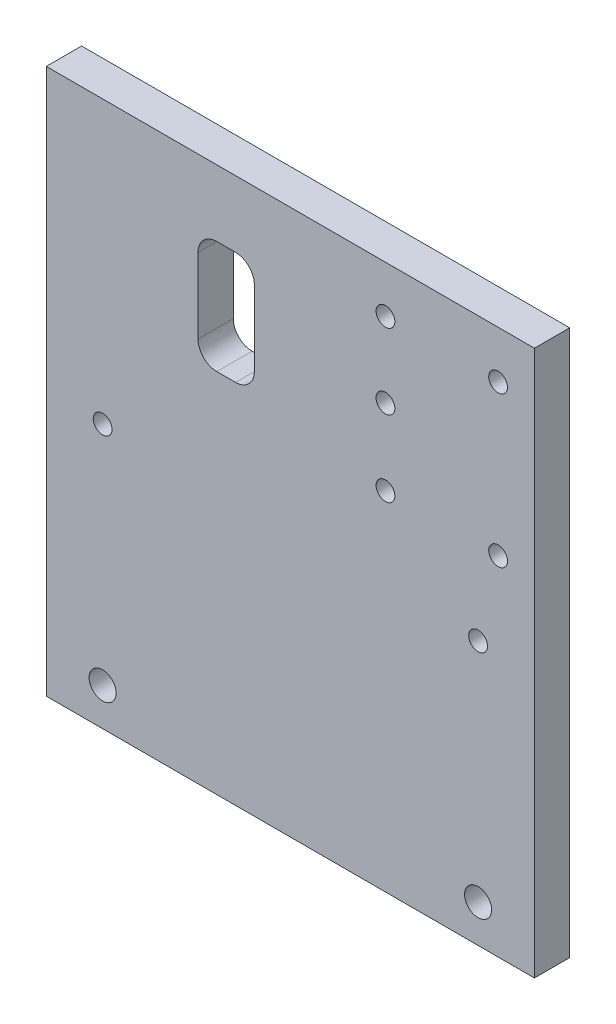
ISO-10303-21;
HEADER;
FILE_DESCRIPTION(('STEP AP214'),'2;1');
FILE_NAME('part.step','',(''),(''),'','','');
FILE_SCHEMA(('AUTOMOTIVE_DESIGN { 1 0 10303 214 1 1 1 1 }'));
ENDSEC;
DATA;
#1=APPLICATION_CONTEXT('core data for automotive mechanical design processes');
#2=APPLICATION_PROTOCOL_DEFINITION('international standard','automotive_design',2000,#1);
#3=PRODUCT_CONTEXT('',#1,'mechanical');
#4=PRODUCT('Part','Part','',(#3));
#5=PRODUCT_RELATED_PRODUCT_CATEGORY('part','',(#4));
#6=PRODUCT_DEFINITION_FORMATION('','',#4);
#7=PRODUCT_DEFINITION_CONTEXT('part definition',#1,'design');
#8=PRODUCT_DEFINITION('design','',#6,#7);
#9=PRODUCT_DEFINITION_SHAPE('','',#8);
#10=(LENGTH_UNIT() NAMED_UNIT(*) SI_UNIT(.MILLI.,.METRE.));
#11=(NAMED_UNIT(*) PLANE_ANGLE_UNIT() SI_UNIT($,.RADIAN.));
#12=(NAMED_UNIT(*) SI_UNIT($,.STERADIAN.) SOLID_ANGLE_UNIT());
#13=UNCERTAINTY_MEASURE_WITH_UNIT(LENGTH_MEASURE(1.E-05),#10,'distance_accuracy_value','');
#14=(GEOMETRIC_REPRESENTATION_CONTEXT(3) GLOBAL_UNCERTAINTY_ASSIGNED_CONTEXT((#13)) GLOBAL_UNIT_ASSIGNED_CONTEXT((#10,
#11,#12)) REPRESENTATION_CONTEXT('',''));
#15=CARTESIAN_POINT('',(0.,0.,0.));
#16=DIRECTION('',(0.,0.,1.));
#17=DIRECTION('',(1.,0.,0.));
#18=AXIS2_PLACEMENT_3D('',#15,#16,#17);
#19=CARTESIAN_POINT('',(0.,0.,9.4));
#20=DIRECTION('',(0.,0.,-1.));
#21=DIRECTION('',(-1.,0.,0.));
#22=AXIS2_PLACEMENT_3D('',#19,#20,#21);
#23=PLANE('',#22);
#24=DIRECTION('',(0.,1.,0.));
#25=VECTOR('',#24,1.);
#26=CARTESIAN_POINT('',(25.4075461399999,87.5703674948168,9.4));
#27=LINE('',#26,#25);
#28=CARTESIAN_POINT('',(25.4075461399999,92.5703674948168,9.4));
#29=VERTEX_POINT('',#28);
#30=CARTESIAN_POINT('',(25.4075461399999,112.570367494817,9.4));
#31=VERTEX_POINT('',#30);
#32=EDGE_CURVE('E202',#29,#31,#27,.T.);
#33=ORIENTED_EDGE('',*,*,#32,.T.);
#34=CARTESIAN_POINT('',(30.4075461399999,112.570367494817,9.4));
#35=DIRECTION('',(0.,0.,-1.));
#36=DIRECTION('',(-1.,0.,0.));
#37=AXIS2_PLACEMENT_3D('',#34,#35,#36);
#38=CIRCLE('',#37,5.);
#39=CARTESIAN_POINT('',(30.4075461399999,117.570367494817,9.4));
#40=VERTEX_POINT('',#39);
#41=EDGE_CURVE('E174',#31,#40,#38,.T.);
#42=ORIENTED_EDGE('',*,*,#41,.T.);
#43=DIRECTION('',(1.,0.,0.));
#44=VECTOR('',#43,1.);
#45=CARTESIAN_POINT('',(40.4075461399999,117.570367494817,9.4));
#46=LINE('',#45,#44);
#47=CARTESIAN_POINT('',(35.4075461399999,117.570367494817,9.4));
#48=VERTEX_POINT('',#47);
#49=EDGE_CURVE('E206',#40,#48,#46,.T.);
#50=ORIENTED_EDGE('',*,*,#49,.T.);
#51=CARTESIAN_POINT('',(35.4075461399999,112.570367494817,9.4));
#52=DIRECTION('',(0.,0.,-1.));
#53=DIRECTION('',(-1.,0.,0.));
#54=AXIS2_PLACEMENT_3D('',#51,#52,#53);
#55=CIRCLE('',#54,5.);
#56=CARTESIAN_POINT('',(40.4075461399999,112.570367494817,9.4));
#57=VERTEX_POINT('',#56);
#58=EDGE_CURVE('E178',#48,#57,#55,.T.);
#59=ORIENTED_EDGE('',*,*,#58,.T.);
#60=DIRECTION('',(0.,-1.,0.));
#61=VECTOR('',#60,1.);
#62=CARTESIAN_POINT('',(40.4075461399999,87.5703674948168,9.4));
#63=LINE('',#62,#61);
#64=CARTESIAN_POINT('',(40.4075461399999,92.5703674948168,9.4));
#65=VERTEX_POINT('',#64);
#66=EDGE_CURVE('E203',#57,#65,#63,.T.);
#67=ORIENTED_EDGE('',*,*,#66,.T.);
#68=CARTESIAN_POINT('',(35.4075461399999,92.5703674948168,9.4));
#69=DIRECTION('',(0.,0.,-1.));
#70=DIRECTION('',(-1.,0.,0.));
#71=AXIS2_PLACEMENT_3D('',#68,#69,#70);
#72=CIRCLE('',#71,5.);
#73=CARTESIAN_POINT('',(35.4075461399999,87.5703674948168,9.4));
#74=VERTEX_POINT('',#73);
#75=EDGE_CURVE('E11',#65,#74,#72,.T.);
#76=ORIENTED_EDGE('',*,*,#75,.T.);
#77=DIRECTION('',(-1.,0.,0.));
#78=VECTOR('',#77,1.);
#79=CARTESIAN_POINT('',(40.4075461399999,87.5703674948168,9.4));
#80=LINE('',#79,#78);
#81=CARTESIAN_POINT('',(30.4075461399999,87.5703674948168,9.4));
#82=VERTEX_POINT('',#81);
#83=EDGE_CURVE('E200',#74,#82,#80,.T.);
#84=ORIENTED_EDGE('',*,*,#83,.T.);
#85=CARTESIAN_POINT('',(30.4075461399999,92.5703674948168,9.4));
#86=DIRECTION('',(0.,0.,-1.));
#87=DIRECTION('',(-1.,0.,0.));
#88=AXIS2_PLACEMENT_3D('',#85,#86,#87);
#89=CIRCLE('',#88,5.);
#90=EDGE_CURVE('E182',#82,#29,#89,.T.);
#91=ORIENTED_EDGE('',*,*,#90,.T.);
#92=EDGE_LOOP('',(#33,#42,#50,#59,#67,#76,#84,#91));
#93=FACE_BOUND('',#92,.T.);
#94=DIRECTION('',(0.,-1.,0.));
#95=VECTOR('',#94,1.);
#96=CARTESIAN_POINT('',(-15.,-10.,9.4));
#97=LINE('',#96,#95);
#98=CARTESIAN_POINT('',(-15.,135.26,9.4));
#99=VERTEX_POINT('',#98);
#100=CARTESIAN_POINT('',(-15.,-10.,9.4));
#101=VERTEX_POINT('',#100);
#102=EDGE_CURVE('E134',#99,#101,#97,.T.);
#103=ORIENTED_EDGE('',*,*,#102,.T.);
#104=DIRECTION('',(1.,0.,0.));
#105=VECTOR('',#104,1.);
#106=CARTESIAN_POINT('',(-15.,-10.,9.4));
#107=LINE('',#106,#105);
#108=CARTESIAN_POINT('',(115.,-10.,9.4));
#109=VERTEX_POINT('',#108);
#110=EDGE_CURVE('E123',#101,#109,#107,.T.);
#111=ORIENTED_EDGE('',*,*,#110,.T.);
#112=DIRECTION('',(0.,1.,0.));
#113=VECTOR('',#112,1.);
#114=CARTESIAN_POINT('',(115.,-10.,9.4));
#115=LINE('',#114,#113);
#116=CARTESIAN_POINT('',(115.,135.26,9.4));
#117=VERTEX_POINT('',#116);
#118=EDGE_CURVE('E133',#109,#117,#115,.T.);
#119=ORIENTED_EDGE('',*,*,#118,.T.);
#120=DIRECTION('',(-1.,0.,0.));
#121=VECTOR('',#120,1.);
#122=CARTESIAN_POINT('',(-15.,135.26,9.4));
#123=LINE('',#122,#121);
#124=EDGE_CURVE('E139',#117,#99,#123,.T.);
#125=ORIENTED_EDGE('',*,*,#124,.T.);
#126=EDGE_LOOP('',(#103,#111,#119,#125));
#127=FACE_BOUND('',#126,.T.);
#128=CARTESIAN_POINT('',(0.,0.,9.4));
#129=DIRECTION('',(0.,0.,1.));
#130=DIRECTION('',(1.,0.,0.));
#131=AXIS2_PLACEMENT_3D('',#128,#129,#130);
#132=CIRCLE('',#131,3.6);
#133=CARTESIAN_POINT('',(3.6,0.,9.4));
#134=VERTEX_POINT('',#133);
#135=EDGE_CURVE('E268',#134,#134,#132,.T.);
#136=ORIENTED_EDGE('',*,*,#135,.F.);
#137=EDGE_LOOP('',(#136));
#138=FACE_BOUND('',#137,.T.);
#139=CARTESIAN_POINT('',(100.,60.26,9.4));
#140=DIRECTION('',(0.,0.,1.));
#141=DIRECTION('',(1.,0.,0.));
#142=AXIS2_PLACEMENT_3D('',#139,#140,#141);
#143=CIRCLE('',#142,2.5);
#144=CARTESIAN_POINT('',(102.5,60.26,9.4));
#145=VERTEX_POINT('',#144);
#146=EDGE_CURVE('E262',#145,#145,#143,.T.);
#147=ORIENTED_EDGE('',*,*,#146,.F.);
#148=EDGE_LOOP('',(#147));
#149=FACE_BOUND('',#148,.T.);
#150=CARTESIAN_POINT('',(0.,60.26,9.4));
#151=DIRECTION('',(0.,0.,1.));
#152=DIRECTION('',(1.,0.,0.));
#153=AXIS2_PLACEMENT_3D('',#150,#151,#152);
#154=CIRCLE('',#153,2.5);
#155=CARTESIAN_POINT('',(2.5,60.26,9.4));
#156=VERTEX_POINT('',#155);
#157=EDGE_CURVE('E256',#156,#156,#154,.T.);
#158=ORIENTED_EDGE('',*,*,#157,.F.);
#159=EDGE_LOOP('',(#158));
#160=FACE_BOUND('',#159,.T.);
#161=CARTESIAN_POINT('',(100.,0.,9.4));
#162=DIRECTION('',(0.,0.,1.));
#163=DIRECTION('',(1.,0.,0.));
#164=AXIS2_PLACEMENT_3D('',#161,#162,#163);
#165=CIRCLE('',#164,3.6);
#166=CARTESIAN_POINT('',(103.6,0.,9.4));
#167=VERTEX_POINT('',#166);
#168=EDGE_CURVE('E250',#167,#167,#165,.T.);
#169=ORIENTED_EDGE('',*,*,#168,.F.);
#170=EDGE_LOOP('',(#169));
#171=FACE_BOUND('',#170,.T.);
#172=CARTESIAN_POINT('',(75.3299999999999,82.555,9.4));
#173=DIRECTION('',(0.,0.,1.));
#174=DIRECTION('',(1.,0.,0.));
#175=AXIS2_PLACEMENT_3D('',#172,#173,#174);
#176=CIRCLE('',#175,2.50000000000001);
#177=CARTESIAN_POINT('',(77.8299999999999,82.555,9.4));
#178=VERTEX_POINT('',#177);
#179=EDGE_CURVE('E244',#178,#178,#176,.T.);
#180=ORIENTED_EDGE('',*,*,#179,.F.);
#181=EDGE_LOOP('',(#180));
#182=FACE_BOUND('',#181,.T.);
#183=CARTESIAN_POINT('',(105.33,82.555,9.4));
#184=DIRECTION('',(0.,0.,1.));
#185=DIRECTION('',(1.,0.,0.));
#186=AXIS2_PLACEMENT_3D('',#183,#184,#185);
#187=CIRCLE('',#186,2.50000000000001);
#188=CARTESIAN_POINT('',(107.83,82.555,9.4));
#189=VERTEX_POINT('',#188);
#190=EDGE_CURVE('E238',#189,#189,#187,.T.);
#191=ORIENTED_EDGE('',*,*,#190,.F.);
#192=EDGE_LOOP('',(#191));
#193=FACE_BOUND('',#192,.T.);
#194=CARTESIAN_POINT('',(105.33,122.635,9.4));
#195=DIRECTION('',(0.,0.,1.));
#196=DIRECTION('',(1.,0.,0.));
#197=AXIS2_PLACEMENT_3D('',#194,#195,#196);
#198=CIRCLE('',#197,2.50000000000001);
#199=CARTESIAN_POINT('',(107.83,122.635,9.4));
#200=VERTEX_POINT('',#199);
#201=EDGE_CURVE('E232',#200,#200,#198,.T.);
#202=ORIENTED_EDGE('',*,*,#201,.F.);
#203=EDGE_LOOP('',(#202));
#204=FACE_BOUND('',#203,.T.);
#205=CARTESIAN_POINT('',(75.3299999999999,122.76641156761,9.4));
#206=DIRECTION('',(0.,0.,1.));
#207=DIRECTION('',(1.,0.,0.));
#208=AXIS2_PLACEMENT_3D('',#205,#206,#207);
#209=CIRCLE('',#208,2.50000000000001);
#210=CARTESIAN_POINT('',(77.8299999999999,122.76641156761,9.4));
#211=VERTEX_POINT('',#210);
#212=EDGE_CURVE('E226',#211,#211,#209,.T.);
#213=ORIENTED_EDGE('',*,*,#212,.F.);
#214=EDGE_LOOP('',(#213));
#215=FACE_BOUND('',#214,.T.);
#216=CARTESIAN_POINT('',(75.3299999999999,102.76641156761,9.4));
#217=DIRECTION('',(0.,0.,1.));
#218=DIRECTION('',(1.,0.,0.));
#219=AXIS2_PLACEMENT_3D('',#216,#217,#218);
#220=CIRCLE('',#219,2.50000000000001);
#221=CARTESIAN_POINT('',(77.8299999999999,102.76641156761,9.4));
#222=VERTEX_POINT('',#221);
#223=EDGE_CURVE('E220',#222,#222,#220,.T.);
#224=ORIENTED_EDGE('',*,*,#223,.F.);
#225=EDGE_LOOP('',(#224));
#226=FACE_BOUND('',#225,.T.);
#227=ADVANCED_FACE('F34',(#93,#127,#138,#149,#160,#171,#182,#193,#204,#215,#226),#23,.F.);
#228=CARTESIAN_POINT('',(0.,0.,0.));
#229=DIRECTION('',(0.,0.,-1.));
#230=DIRECTION('',(-1.,0.,0.));
#231=AXIS2_PLACEMENT_3D('',#228,#229,#230);
#232=PLANE('',#231);
#233=DIRECTION('',(0.,-1.,0.));
#234=VECTOR('',#233,1.);
#235=CARTESIAN_POINT('',(40.4075461399999,87.5703674948168,0.));
#236=LINE('',#235,#234);
#237=CARTESIAN_POINT('',(40.4075461399999,112.570367494817,0.));
#238=VERTEX_POINT('',#237);
#239=CARTESIAN_POINT('',(40.4075461399999,92.5703674948168,0.));
#240=VERTEX_POINT('',#239);
#241=EDGE_CURVE('E189',#238,#240,#236,.T.);
#242=ORIENTED_EDGE('',*,*,#241,.F.);
#243=CARTESIAN_POINT('',(35.4075461399999,112.570367494817,0.));
#244=DIRECTION('',(0.,0.,-1.));
#245=DIRECTION('',(-1.,0.,0.));
#246=AXIS2_PLACEMENT_3D('',#243,#244,#245);
#247=CIRCLE('',#246,5.);
#248=CARTESIAN_POINT('',(35.4075461399999,117.570367494817,0.));
#249=VERTEX_POINT('',#248);
#250=EDGE_CURVE('E176',#238,#249,#247,.F.);
#251=ORIENTED_EDGE('',*,*,#250,.T.);
#252=DIRECTION('',(1.,0.,0.));
#253=VECTOR('',#252,1.);
#254=CARTESIAN_POINT('',(40.4075461399999,117.570367494817,0.));
#255=LINE('',#254,#253);
#256=CARTESIAN_POINT('',(30.4075461399999,117.570367494817,0.));
#257=VERTEX_POINT('',#256);
#258=EDGE_CURVE('E208',#257,#249,#255,.T.);
#259=ORIENTED_EDGE('',*,*,#258,.F.);
#260=CARTESIAN_POINT('',(30.4075461399999,112.570367494817,0.));
#261=DIRECTION('',(0.,0.,-1.));
#262=DIRECTION('',(-1.,0.,0.));
#263=AXIS2_PLACEMENT_3D('',#260,#261,#262);
#264=CIRCLE('',#263,5.);
#265=CARTESIAN_POINT('',(25.4075461399999,112.570367494817,0.));
#266=VERTEX_POINT('',#265);
#267=EDGE_CURVE('E172',#257,#266,#264,.F.);
#268=ORIENTED_EDGE('',*,*,#267,.T.);
#269=DIRECTION('',(0.,1.,0.));
#270=VECTOR('',#269,1.);
#271=CARTESIAN_POINT('',(25.4075461399999,87.5703674948168,0.));
#272=LINE('',#271,#270);
#273=CARTESIAN_POINT('',(25.4075461399999,92.5703674948168,0.));
#274=VERTEX_POINT('',#273);
#275=EDGE_CURVE('E215',#274,#266,#272,.T.);
#276=ORIENTED_EDGE('',*,*,#275,.F.);
#277=CARTESIAN_POINT('',(30.4075461399999,92.5703674948168,0.));
#278=DIRECTION('',(0.,0.,-1.));
#279=DIRECTION('',(-1.,0.,0.));
#280=AXIS2_PLACEMENT_3D('',#277,#278,#279);
#281=CIRCLE('',#280,5.);
#282=CARTESIAN_POINT('',(30.4075461399999,87.5703674948168,0.));
#283=VERTEX_POINT('',#282);
#284=EDGE_CURVE('E180',#274,#283,#281,.F.);
#285=ORIENTED_EDGE('',*,*,#284,.T.);
#286=DIRECTION('',(-1.,0.,0.));
#287=VECTOR('',#286,1.);
#288=CARTESIAN_POINT('',(40.4075461399999,87.5703674948168,0.));
#289=LINE('',#288,#287);
#290=CARTESIAN_POINT('',(35.4075461399999,87.5703674948168,0.));
#291=VERTEX_POINT('',#290);
#292=EDGE_CURVE('E190',#291,#283,#289,.T.);
#293=ORIENTED_EDGE('',*,*,#292,.F.);
#294=CARTESIAN_POINT('',(35.4075461399999,92.5703674948168,0.));
#295=DIRECTION('',(0.,0.,-1.));
#296=DIRECTION('',(-1.,0.,0.));
#297=AXIS2_PLACEMENT_3D('',#294,#295,#296);
#298=CIRCLE('',#297,5.);
#299=EDGE_CURVE('E42',#291,#240,#298,.F.);
#300=ORIENTED_EDGE('',*,*,#299,.T.);
#301=EDGE_LOOP('',(#242,#251,#259,#268,#276,#285,#293,#300));
#302=FACE_BOUND('',#301,.T.);
#303=CARTESIAN_POINT('',(75.3299999999999,122.76641156761,0.));
#304=DIRECTION('',(0.,0.,1.));
#305=DIRECTION('',(1.,0.,0.));
#306=AXIS2_PLACEMENT_3D('',#303,#304,#305);
#307=CIRCLE('',#306,2.50000000000001);
#308=CARTESIAN_POINT('',(77.8299999999999,122.76641156761,0.));
#309=VERTEX_POINT('',#308);
#310=EDGE_CURVE('E223',#309,#309,#307,.T.);
#311=ORIENTED_EDGE('',*,*,#310,.T.);
#312=EDGE_LOOP('',(#311));
#313=FACE_BOUND('',#312,.T.);
#314=CARTESIAN_POINT('',(105.33,82.555,0.));
#315=DIRECTION('',(0.,0.,1.));
#316=DIRECTION('',(1.,0.,0.));
#317=AXIS2_PLACEMENT_3D('',#314,#315,#316);
#318=CIRCLE('',#317,2.50000000000001);
#319=CARTESIAN_POINT('',(107.83,82.555,0.));
#320=VERTEX_POINT('',#319);
#321=EDGE_CURVE('E235',#320,#320,#318,.T.);
#322=ORIENTED_EDGE('',*,*,#321,.T.);
#323=EDGE_LOOP('',(#322));
#324=FACE_BOUND('',#323,.T.);
#325=CARTESIAN_POINT('',(100.,0.,0.));
#326=DIRECTION('',(0.,0.,1.));
#327=DIRECTION('',(1.,0.,0.));
#328=AXIS2_PLACEMENT_3D('',#325,#326,#327);
#329=CIRCLE('',#328,3.6);
#330=CARTESIAN_POINT('',(103.6,0.,0.));
#331=VERTEX_POINT('',#330);
#332=EDGE_CURVE('E247',#331,#331,#329,.T.);
#333=ORIENTED_EDGE('',*,*,#332,.T.);
#334=EDGE_LOOP('',(#333));
#335=FACE_BOUND('',#334,.T.);
#336=CARTESIAN_POINT('',(100.,60.26,0.));
#337=DIRECTION('',(0.,0.,1.));
#338=DIRECTION('',(1.,0.,0.));
#339=AXIS2_PLACEMENT_3D('',#336,#337,#338);
#340=CIRCLE('',#339,2.5);
#341=CARTESIAN_POINT('',(102.5,60.26,0.));
#342=VERTEX_POINT('',#341);
#343=EDGE_CURVE('E259',#342,#342,#340,.T.);
#344=ORIENTED_EDGE('',*,*,#343,.T.);
#345=EDGE_LOOP('',(#344));
#346=FACE_BOUND('',#345,.T.);
#347=DIRECTION('',(0.,-1.,0.));
#348=VECTOR('',#347,1.);
#349=CARTESIAN_POINT('',(-15.,-10.,0.));
#350=LINE('',#349,#348);
#351=CARTESIAN_POINT('',(-15.,135.26,0.));
#352=VERTEX_POINT('',#351);
#353=CARTESIAN_POINT('',(-15.,-10.,0.));
#354=VERTEX_POINT('',#353);
#355=EDGE_CURVE('E147',#352,#354,#350,.T.);
#356=ORIENTED_EDGE('',*,*,#355,.F.);
#357=DIRECTION('',(-1.,0.,0.));
#358=VECTOR('',#357,1.);
#359=CARTESIAN_POINT('',(-15.,135.26,0.));
#360=LINE('',#359,#358);
#361=CARTESIAN_POINT('',(115.,135.26,0.));
#362=VERTEX_POINT('',#361);
#363=EDGE_CURVE('E143',#362,#352,#360,.T.);
#364=ORIENTED_EDGE('',*,*,#363,.F.);
#365=DIRECTION('',(0.,1.,0.));
#366=VECTOR('',#365,1.);
#367=CARTESIAN_POINT('',(115.,-10.,0.));
#368=LINE('',#367,#366);
#369=CARTESIAN_POINT('',(115.,-10.,0.));
#370=VERTEX_POINT('',#369);
#371=EDGE_CURVE('E279',#370,#362,#368,.T.);
#372=ORIENTED_EDGE('',*,*,#371,.F.);
#373=DIRECTION('',(1.,0.,0.));
#374=VECTOR('',#373,1.);
#375=CARTESIAN_POINT('',(-15.,-10.,0.));
#376=LINE('',#375,#374);
#377=EDGE_CURVE('E277',#354,#370,#376,.T.);
#378=ORIENTED_EDGE('',*,*,#377,.F.);
#379=EDGE_LOOP('',(#356,#364,#372,#378));
#380=FACE_BOUND('',#379,.T.);
#381=CARTESIAN_POINT('',(0.,0.,0.));
#382=DIRECTION('',(0.,0.,1.));
#383=DIRECTION('',(1.,0.,0.));
#384=AXIS2_PLACEMENT_3D('',#381,#382,#383);
#385=CIRCLE('',#384,3.6);
#386=CARTESIAN_POINT('',(3.6,0.,0.));
#387=VERTEX_POINT('',#386);
#388=EDGE_CURVE('E265',#387,#387,#385,.T.);
#389=ORIENTED_EDGE('',*,*,#388,.T.);
#390=EDGE_LOOP('',(#389));
#391=FACE_BOUND('',#390,.T.);
#392=CARTESIAN_POINT('',(0.,60.26,0.));
#393=DIRECTION('',(0.,0.,1.));
#394=DIRECTION('',(1.,0.,0.));
#395=AXIS2_PLACEMENT_3D('',#392,#393,#394);
#396=CIRCLE('',#395,2.5);
#397=CARTESIAN_POINT('',(2.5,60.26,0.));
#398=VERTEX_POINT('',#397);
#399=EDGE_CURVE('E253',#398,#398,#396,.T.);
#400=ORIENTED_EDGE('',*,*,#399,.T.);
#401=EDGE_LOOP('',(#400));
#402=FACE_BOUND('',#401,.T.);
#403=CARTESIAN_POINT('',(75.3299999999999,82.555,0.));
#404=DIRECTION('',(0.,0.,1.));
#405=DIRECTION('',(1.,0.,0.));
#406=AXIS2_PLACEMENT_3D('',#403,#404,#405);
#407=CIRCLE('',#406,2.50000000000001);
#408=CARTESIAN_POINT('',(77.8299999999999,82.555,0.));
#409=VERTEX_POINT('',#408);
#410=EDGE_CURVE('E241',#409,#409,#407,.T.);
#411=ORIENTED_EDGE('',*,*,#410,.T.);
#412=EDGE_LOOP('',(#411));
#413=FACE_BOUND('',#412,.T.);
#414=CARTESIAN_POINT('',(105.33,122.635,0.));
#415=DIRECTION('',(0.,0.,1.));
#416=DIRECTION('',(1.,0.,0.));
#417=AXIS2_PLACEMENT_3D('',#414,#415,#416);
#418=CIRCLE('',#417,2.50000000000001);
#419=CARTESIAN_POINT('',(107.83,122.635,0.));
#420=VERTEX_POINT('',#419);
#421=EDGE_CURVE('E229',#420,#420,#418,.T.);
#422=ORIENTED_EDGE('',*,*,#421,.T.);
#423=EDGE_LOOP('',(#422));
#424=FACE_BOUND('',#423,.T.);
#425=CARTESIAN_POINT('',(75.3299999999999,102.76641156761,0.));
#426=DIRECTION('',(0.,0.,1.));
#427=DIRECTION('',(1.,0.,0.));
#428=AXIS2_PLACEMENT_3D('',#425,#426,#427);
#429=CIRCLE('',#428,2.50000000000001);
#430=CARTESIAN_POINT('',(77.8299999999999,102.76641156761,0.));
#431=VERTEX_POINT('',#430);
#432=EDGE_CURVE('E212',#431,#431,#429,.T.);
#433=ORIENTED_EDGE('',*,*,#432,.T.);
#434=EDGE_LOOP('',(#433));
#435=FACE_BOUND('',#434,.T.);
#436=ADVANCED_FACE('F187',(#302,#313,#324,#335,#346,#380,#391,#402,#413,#424,#435),#232,.T.);
#437=CARTESIAN_POINT('',(-15.,-10.,9.4));
#438=DIRECTION('',(1.,0.,0.));
#439=DIRECTION('',(0.,0.,-1.));
#440=AXIS2_PLACEMENT_3D('',#437,#438,#439);
#441=PLANE('',#440);
#442=ORIENTED_EDGE('',*,*,#355,.T.);
#443=DIRECTION('',(0.,0.,-1.));
#444=VECTOR('',#443,1.);
#445=CARTESIAN_POINT('',(-15.,-10.,9.4));
#446=LINE('',#445,#444);
#447=EDGE_CURVE('E127',#101,#354,#446,.T.);
#448=ORIENTED_EDGE('',*,*,#447,.F.);
#449=ORIENTED_EDGE('',*,*,#102,.F.);
#450=DIRECTION('',(0.,0.,-1.));
#451=VECTOR('',#450,1.);
#452=CARTESIAN_POINT('',(-15.,135.26,9.4));
#453=LINE('',#452,#451);
#454=EDGE_CURVE('E275',#99,#352,#453,.T.);
#455=ORIENTED_EDGE('',*,*,#454,.T.);
#456=EDGE_LOOP('',(#442,#448,#449,#455));
#457=FACE_BOUND('',#456,.T.);
#458=ADVANCED_FACE('F145',(#457),#441,.F.);
#459=CARTESIAN_POINT('',(-15.,-10.,9.4));
#460=DIRECTION('',(0.,1.,0.));
#461=DIRECTION('',(0.,0.,1.));
#462=AXIS2_PLACEMENT_3D('',#459,#460,#461);
#463=PLANE('',#462);
#464=ORIENTED_EDGE('',*,*,#377,.T.);
#465=DIRECTION('',(0.,0.,-1.));
#466=VECTOR('',#465,1.);
#467=CARTESIAN_POINT('',(115.,-10.,9.4));
#468=LINE('',#467,#466);
#469=EDGE_CURVE('E130',#109,#370,#468,.T.);
#470=ORIENTED_EDGE('',*,*,#469,.F.);
#471=ORIENTED_EDGE('',*,*,#110,.F.);
#472=ORIENTED_EDGE('',*,*,#447,.T.);
#473=EDGE_LOOP('',(#464,#470,#471,#472));
#474=FACE_BOUND('',#473,.T.);
#475=ADVANCED_FACE('F125',(#474),#463,.F.);
#476=CARTESIAN_POINT('',(115.,-10.,9.4));
#477=DIRECTION('',(-1.,0.,0.));
#478=DIRECTION('',(0.,0.,1.));
#479=AXIS2_PLACEMENT_3D('',#476,#477,#478);
#480=PLANE('',#479);
#481=ORIENTED_EDGE('',*,*,#371,.T.);
#482=DIRECTION('',(0.,0.,-1.));
#483=VECTOR('',#482,1.);
#484=CARTESIAN_POINT('',(115.,135.26,9.4));
#485=LINE('',#484,#483);
#486=EDGE_CURVE('E152',#117,#362,#485,.T.);
#487=ORIENTED_EDGE('',*,*,#486,.F.);
#488=ORIENTED_EDGE('',*,*,#118,.F.);
#489=ORIENTED_EDGE('',*,*,#469,.T.);
#490=EDGE_LOOP('',(#481,#487,#488,#489));
#491=FACE_BOUND('',#490,.T.);
#492=ADVANCED_FACE('F291',(#491),#480,.F.);
#493=CARTESIAN_POINT('',(-15.,135.26,9.4));
#494=DIRECTION('',(0.,-1.,0.));
#495=DIRECTION('',(0.,0.,-1.));
#496=AXIS2_PLACEMENT_3D('',#493,#494,#495);
#497=PLANE('',#496);
#498=ORIENTED_EDGE('',*,*,#363,.T.);
#499=ORIENTED_EDGE('',*,*,#454,.F.);
#500=ORIENTED_EDGE('',*,*,#124,.F.);
#501=ORIENTED_EDGE('',*,*,#486,.T.);
#502=EDGE_LOOP('',(#498,#499,#500,#501));
#503=FACE_BOUND('',#502,.T.);
#504=ADVANCED_FACE('F286',(#503),#497,.F.);
#505=CARTESIAN_POINT('',(0.,0.,9.4));
#506=DIRECTION('',(0.,0.,-1.));
#507=DIRECTION('',(-1.,0.,0.));
#508=AXIS2_PLACEMENT_3D('',#505,#506,#507);
#509=CYLINDRICAL_SURFACE('',#508,3.6);
#510=ORIENTED_EDGE('',*,*,#135,.T.);
#511=EDGE_LOOP('',(#510));
#512=FACE_BOUND('',#511,.T.);
#513=ORIENTED_EDGE('',*,*,#388,.F.);
#514=EDGE_LOOP('',(#513));
#515=FACE_BOUND('',#514,.T.);
#516=ADVANCED_FACE('F298',(#512,#515),#509,.F.);
#517=CARTESIAN_POINT('',(100.,60.26,9.4));
#518=DIRECTION('',(0.,0.,-1.));
#519=DIRECTION('',(-1.,0.,0.));
#520=AXIS2_PLACEMENT_3D('',#517,#518,#519);
#521=CYLINDRICAL_SURFACE('',#520,2.5);
#522=ORIENTED_EDGE('',*,*,#146,.T.);
#523=EDGE_LOOP('',(#522));
#524=FACE_BOUND('',#523,.T.);
#525=ORIENTED_EDGE('',*,*,#343,.F.);
#526=EDGE_LOOP('',(#525));
#527=FACE_BOUND('',#526,.T.);
#528=ADVANCED_FACE('F310',(#524,#527),#521,.F.);
#529=CARTESIAN_POINT('',(0.,60.26,9.4));
#530=DIRECTION('',(0.,0.,-1.));
#531=DIRECTION('',(-1.,0.,0.));
#532=AXIS2_PLACEMENT_3D('',#529,#530,#531);
#533=CYLINDRICAL_SURFACE('',#532,2.5);
#534=ORIENTED_EDGE('',*,*,#157,.T.);
#535=EDGE_LOOP('',(#534));
#536=FACE_BOUND('',#535,.T.);
#537=ORIENTED_EDGE('',*,*,#399,.F.);
#538=EDGE_LOOP('',(#537));
#539=FACE_BOUND('',#538,.T.);
#540=ADVANCED_FACE('F314',(#536,#539),#533,.F.);
#541=CARTESIAN_POINT('',(100.,0.,9.4));
#542=DIRECTION('',(0.,0.,-1.));
#543=DIRECTION('',(-1.,0.,0.));
#544=AXIS2_PLACEMENT_3D('',#541,#542,#543);
#545=CYLINDRICAL_SURFACE('',#544,3.6);
#546=ORIENTED_EDGE('',*,*,#168,.T.);
#547=EDGE_LOOP('',(#546));
#548=FACE_BOUND('',#547,.T.);
#549=ORIENTED_EDGE('',*,*,#332,.F.);
#550=EDGE_LOOP('',(#549));
#551=FACE_BOUND('',#550,.T.);
#552=ADVANCED_FACE('F318',(#548,#551),#545,.F.);
#553=CARTESIAN_POINT('',(75.3299999999999,82.555,9.4));
#554=DIRECTION('',(0.,0.,-1.));
#555=DIRECTION('',(-1.,0.,0.));
#556=AXIS2_PLACEMENT_3D('',#553,#554,#555);
#557=CYLINDRICAL_SURFACE('',#556,2.50000000000001);
#558=ORIENTED_EDGE('',*,*,#179,.T.);
#559=EDGE_LOOP('',(#558));
#560=FACE_BOUND('',#559,.T.);
#561=ORIENTED_EDGE('',*,*,#410,.F.);
#562=EDGE_LOOP('',(#561));
#563=FACE_BOUND('',#562,.T.);
#564=ADVANCED_FACE('F322',(#560,#563),#557,.F.);
#565=CARTESIAN_POINT('',(105.33,82.555,9.4));
#566=DIRECTION('',(0.,0.,-1.));
#567=DIRECTION('',(-1.,0.,0.));
#568=AXIS2_PLACEMENT_3D('',#565,#566,#567);
#569=CYLINDRICAL_SURFACE('',#568,2.50000000000001);
#570=ORIENTED_EDGE('',*,*,#190,.T.);
#571=EDGE_LOOP('',(#570));
#572=FACE_BOUND('',#571,.T.);
#573=ORIENTED_EDGE('',*,*,#321,.F.);
#574=EDGE_LOOP('',(#573));
#575=FACE_BOUND('',#574,.T.);
#576=ADVANCED_FACE('F326',(#572,#575),#569,.F.);
#577=CARTESIAN_POINT('',(105.33,122.635,9.4));
#578=DIRECTION('',(0.,0.,-1.));
#579=DIRECTION('',(-1.,0.,0.));
#580=AXIS2_PLACEMENT_3D('',#577,#578,#579);
#581=CYLINDRICAL_SURFACE('',#580,2.50000000000001);
#582=ORIENTED_EDGE('',*,*,#201,.T.);
#583=EDGE_LOOP('',(#582));
#584=FACE_BOUND('',#583,.T.);
#585=ORIENTED_EDGE('',*,*,#421,.F.);
#586=EDGE_LOOP('',(#585));
#587=FACE_BOUND('',#586,.T.);
#588=ADVANCED_FACE('F330',(#584,#587),#581,.F.);
#589=CARTESIAN_POINT('',(75.3299999999999,122.76641156761,9.4));
#590=DIRECTION('',(0.,0.,-1.));
#591=DIRECTION('',(-1.,0.,0.));
#592=AXIS2_PLACEMENT_3D('',#589,#590,#591);
#593=CYLINDRICAL_SURFACE('',#592,2.50000000000001);
#594=ORIENTED_EDGE('',*,*,#212,.T.);
#595=EDGE_LOOP('',(#594));
#596=FACE_BOUND('',#595,.T.);
#597=ORIENTED_EDGE('',*,*,#310,.F.);
#598=EDGE_LOOP('',(#597));
#599=FACE_BOUND('',#598,.T.);
#600=ADVANCED_FACE('F334',(#596,#599),#593,.F.);
#601=CARTESIAN_POINT('',(75.3299999999999,102.76641156761,9.4));
#602=DIRECTION('',(0.,0.,-1.));
#603=DIRECTION('',(-1.,0.,0.));
#604=AXIS2_PLACEMENT_3D('',#601,#602,#603);
#605=CYLINDRICAL_SURFACE('',#604,2.50000000000001);
#606=ORIENTED_EDGE('',*,*,#223,.T.);
#607=EDGE_LOOP('',(#606));
#608=FACE_BOUND('',#607,.T.);
#609=ORIENTED_EDGE('',*,*,#432,.F.);
#610=EDGE_LOOP('',(#609));
#611=FACE_BOUND('',#610,.T.);
#612=ADVANCED_FACE('F338',(#608,#611),#605,.F.);
#613=CARTESIAN_POINT('',(40.4075461399999,87.5703674948168,9.4));
#614=DIRECTION('',(1.,0.,0.));
#615=DIRECTION('',(0.,0.,-1.));
#616=AXIS2_PLACEMENT_3D('',#613,#614,#615);
#617=PLANE('',#616);
#618=ORIENTED_EDGE('',*,*,#66,.F.);
#619=DIRECTION('',(0.,0.,-1.));
#620=VECTOR('',#619,1.);
#621=CARTESIAN_POINT('',(40.4075461399999,112.570367494817,0.));
#622=LINE('',#621,#620);
#623=EDGE_CURVE('E165',#57,#238,#622,.T.);
#624=ORIENTED_EDGE('',*,*,#623,.T.);
#625=ORIENTED_EDGE('',*,*,#241,.T.);
#626=DIRECTION('',(0.,0.,-1.));
#627=VECTOR('',#626,1.);
#628=CARTESIAN_POINT('',(40.4075461399999,92.5703674948168,9.4));
#629=LINE('',#628,#627);
#630=EDGE_CURVE('E163',#240,#65,#629,.F.);
#631=ORIENTED_EDGE('',*,*,#630,.T.);
#632=EDGE_LOOP('',(#618,#624,#625,#631));
#633=FACE_BOUND('',#632,.T.);
#634=ADVANCED_FACE('F196',(#633),#617,.F.);
#635=CARTESIAN_POINT('',(40.4075461399999,117.570367494817,9.4));
#636=DIRECTION('',(0.,1.,0.));
#637=DIRECTION('',(0.,0.,1.));
#638=AXIS2_PLACEMENT_3D('',#635,#636,#637);
#639=PLANE('',#638);
#640=ORIENTED_EDGE('',*,*,#49,.F.);
#641=DIRECTION('',(0.,0.,-1.));
#642=VECTOR('',#641,1.);
#643=CARTESIAN_POINT('',(30.4075461399999,117.570367494817,0.));
#644=LINE('',#643,#642);
#645=EDGE_CURVE('E150',#40,#257,#644,.T.);
#646=ORIENTED_EDGE('',*,*,#645,.T.);
#647=ORIENTED_EDGE('',*,*,#258,.T.);
#648=DIRECTION('',(0.,0.,-1.));
#649=VECTOR('',#648,1.);
#650=CARTESIAN_POINT('',(35.4075461399999,117.570367494817,9.4));
#651=LINE('',#650,#649);
#652=EDGE_CURVE('E148',#249,#48,#651,.F.);
#653=ORIENTED_EDGE('',*,*,#652,.T.);
#654=EDGE_LOOP('',(#640,#646,#647,#653));
#655=FACE_BOUND('',#654,.T.);
#656=ADVANCED_FACE('F345',(#655),#639,.F.);
#657=CARTESIAN_POINT('',(25.4075461399999,87.5703674948168,9.4));
#658=DIRECTION('',(-1.,0.,0.));
#659=DIRECTION('',(0.,0.,1.));
#660=AXIS2_PLACEMENT_3D('',#657,#658,#659);
#661=PLANE('',#660);
#662=ORIENTED_EDGE('',*,*,#275,.T.);
#663=DIRECTION('',(0.,0.,-1.));
#664=VECTOR('',#663,1.);
#665=CARTESIAN_POINT('',(25.4075461399999,112.570367494817,9.4));
#666=LINE('',#665,#664);
#667=EDGE_CURVE('E161',#266,#31,#666,.F.);
#668=ORIENTED_EDGE('',*,*,#667,.T.);
#669=ORIENTED_EDGE('',*,*,#32,.F.);
#670=DIRECTION('',(0.,0.,-1.));
#671=VECTOR('',#670,1.);
#672=CARTESIAN_POINT('',(25.4075461399999,92.5703674948168,0.));
#673=LINE('',#672,#671);
#674=EDGE_CURVE('E158',#29,#274,#673,.T.);
#675=ORIENTED_EDGE('',*,*,#674,.T.);
#676=EDGE_LOOP('',(#662,#668,#669,#675));
#677=FACE_BOUND('',#676,.T.);
#678=ADVANCED_FACE('F349',(#677),#661,.F.);
#679=CARTESIAN_POINT('',(40.4075461399999,87.5703674948168,9.4));
#680=DIRECTION('',(0.,-1.,0.));
#681=DIRECTION('',(0.,0.,-1.));
#682=AXIS2_PLACEMENT_3D('',#679,#680,#681);
#683=PLANE('',#682);
#684=ORIENTED_EDGE('',*,*,#292,.T.);
#685=DIRECTION('',(0.,0.,-1.));
#686=VECTOR('',#685,1.);
#687=CARTESIAN_POINT('',(30.4075461399999,87.5703674948168,9.4));
#688=LINE('',#687,#686);
#689=EDGE_CURVE('E49',#283,#82,#688,.F.);
#690=ORIENTED_EDGE('',*,*,#689,.T.);
#691=ORIENTED_EDGE('',*,*,#83,.F.);
#692=DIRECTION('',(0.,0.,-1.));
#693=VECTOR('',#692,1.);
#694=CARTESIAN_POINT('',(35.4075461399999,87.5703674948168,0.));
#695=LINE('',#694,#693);
#696=EDGE_CURVE('E168',#74,#291,#695,.T.);
#697=ORIENTED_EDGE('',*,*,#696,.T.);
#698=EDGE_LOOP('',(#684,#690,#691,#697));
#699=FACE_BOUND('',#698,.T.);
#700=ADVANCED_FACE('F199',(#699),#683,.F.);
#701=CARTESIAN_POINT('',(30.4075461399999,112.570367494817,9.4));
#702=DIRECTION('',(0.,0.,1.));
#703=DIRECTION('',(1.,0.,0.));
#704=AXIS2_PLACEMENT_3D('',#701,#702,#703);
#705=CYLINDRICAL_SURFACE('',#704,5.);
#706=ORIENTED_EDGE('',*,*,#41,.F.);
#707=ORIENTED_EDGE('',*,*,#667,.F.);
#708=ORIENTED_EDGE('',*,*,#267,.F.);
#709=ORIENTED_EDGE('',*,*,#645,.F.);
#710=EDGE_LOOP('',(#706,#707,#708,#709));
#711=FACE_BOUND('',#710,.T.);
#712=ADVANCED_FACE('F348',(#711),#705,.F.);
#713=CARTESIAN_POINT('',(35.4075461399999,112.570367494817,9.4));
#714=DIRECTION('',(0.,0.,1.));
#715=DIRECTION('',(1.,0.,0.));
#716=AXIS2_PLACEMENT_3D('',#713,#714,#715);
#717=CYLINDRICAL_SURFACE('',#716,5.);
#718=ORIENTED_EDGE('',*,*,#58,.F.);
#719=ORIENTED_EDGE('',*,*,#652,.F.);
#720=ORIENTED_EDGE('',*,*,#250,.F.);
#721=ORIENTED_EDGE('',*,*,#623,.F.);
#722=EDGE_LOOP('',(#718,#719,#720,#721));
#723=FACE_BOUND('',#722,.T.);
#724=ADVANCED_FACE('F371',(#723),#717,.F.);
#725=CARTESIAN_POINT('',(30.4075461399999,92.5703674948168,9.4));
#726=DIRECTION('',(0.,0.,1.));
#727=DIRECTION('',(1.,0.,0.));
#728=AXIS2_PLACEMENT_3D('',#725,#726,#727);
#729=CYLINDRICAL_SURFACE('',#728,5.);
#730=ORIENTED_EDGE('',*,*,#90,.F.);
#731=ORIENTED_EDGE('',*,*,#689,.F.);
#732=ORIENTED_EDGE('',*,*,#284,.F.);
#733=ORIENTED_EDGE('',*,*,#674,.F.);
#734=EDGE_LOOP('',(#730,#731,#732,#733));
#735=FACE_BOUND('',#734,.T.);
#736=ADVANCED_FACE('F369',(#735),#729,.F.);
#737=CARTESIAN_POINT('',(35.4075461399999,92.5703674948168,9.4));
#738=DIRECTION('',(0.,0.,1.));
#739=DIRECTION('',(1.,0.,0.));
#740=AXIS2_PLACEMENT_3D('',#737,#738,#739);
#741=CYLINDRICAL_SURFACE('',#740,5.);
#742=ORIENTED_EDGE('',*,*,#75,.F.);
#743=ORIENTED_EDGE('',*,*,#630,.F.);
#744=ORIENTED_EDGE('',*,*,#299,.F.);
#745=ORIENTED_EDGE('',*,*,#696,.F.);
#746=EDGE_LOOP('',(#742,#743,#744,#745));
#747=FACE_BOUND('',#746,.T.);
#748=ADVANCED_FACE('F36',(#747),#741,.F.);
#749=CLOSED_SHELL('',(#227,#436,#458,#475,#492,#504,#516,#528,#540,#552,#564,#576,#588,#600,
#612,#634,#656,#678,#700,#712,#724,#736,#748));
#750=MANIFOLD_SOLID_BREP('B2',#749);
#751=ADVANCED_BREP_SHAPE_REPRESENTATION('',(#18,#750),#14);
#752=SHAPE_DEFINITION_REPRESENTATION(#9,#751);
ENDSEC;
END-ISO-10303-21;
